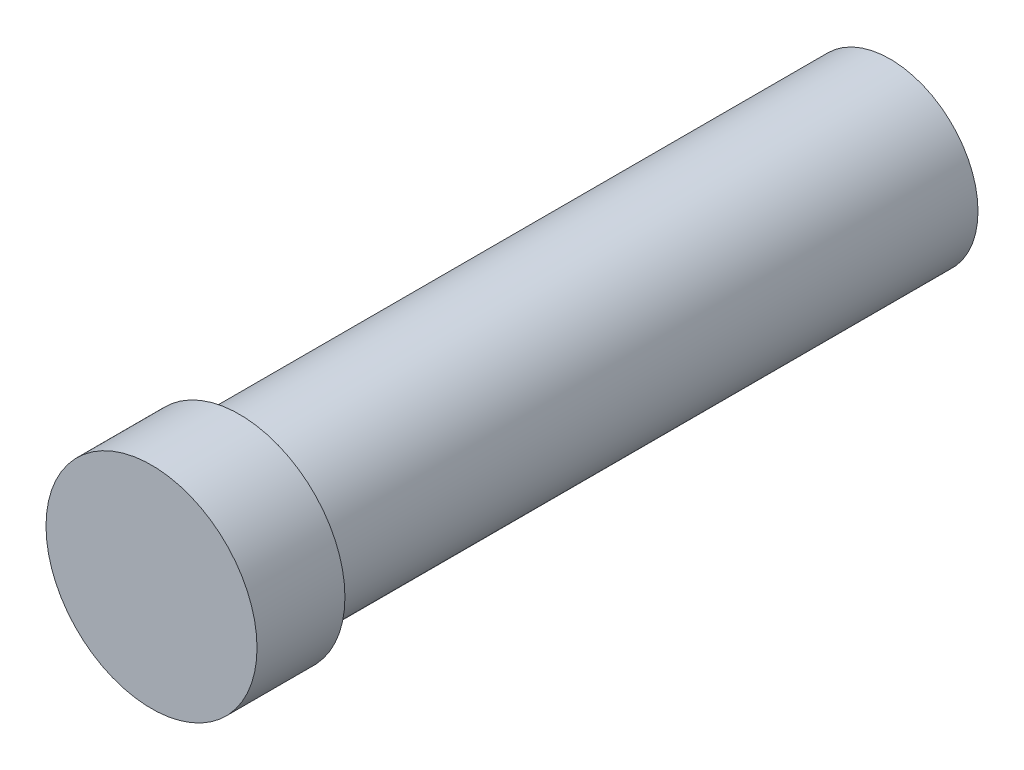
ISO-10303-21;
HEADER;
FILE_DESCRIPTION(('STEP AP214'),'2;1');
FILE_NAME('part.step','',(''),(''),'','','');
FILE_SCHEMA(('AUTOMOTIVE_DESIGN { 1 0 10303 214 1 1 1 1 }'));
ENDSEC;
DATA;
#1=APPLICATION_CONTEXT('core data for automotive mechanical design processes');
#2=APPLICATION_PROTOCOL_DEFINITION('international standard','automotive_design',2000,#1);
#3=PRODUCT_CONTEXT('',#1,'mechanical');
#4=PRODUCT('Part','Part','',(#3));
#5=PRODUCT_RELATED_PRODUCT_CATEGORY('part','',(#4));
#6=PRODUCT_DEFINITION_FORMATION('','',#4);
#7=PRODUCT_DEFINITION_CONTEXT('part definition',#1,'design');
#8=PRODUCT_DEFINITION('design','',#6,#7);
#9=PRODUCT_DEFINITION_SHAPE('','',#8);
#10=(LENGTH_UNIT() NAMED_UNIT(*) SI_UNIT(.MILLI.,.METRE.));
#11=(NAMED_UNIT(*) PLANE_ANGLE_UNIT() SI_UNIT($,.RADIAN.));
#12=(NAMED_UNIT(*) SI_UNIT($,.STERADIAN.) SOLID_ANGLE_UNIT());
#13=UNCERTAINTY_MEASURE_WITH_UNIT(LENGTH_MEASURE(1.E-05),#10,'distance_accuracy_value','');
#14=(GEOMETRIC_REPRESENTATION_CONTEXT(3) GLOBAL_UNCERTAINTY_ASSIGNED_CONTEXT((#13)) GLOBAL_UNIT_ASSIGNED_CONTEXT((#10,
#11,#12)) REPRESENTATION_CONTEXT('',''));
#15=CARTESIAN_POINT('',(0.,0.,0.));
#16=DIRECTION('',(0.,0.,1.));
#17=DIRECTION('',(1.,0.,0.));
#18=AXIS2_PLACEMENT_3D('',#15,#16,#17);
#19=CARTESIAN_POINT('',(0.,0.,37.));
#20=DIRECTION('',(0.,0.,-1.));
#21=DIRECTION('',(-1.,0.,0.));
#22=AXIS2_PLACEMENT_3D('',#19,#20,#21);
#23=CYLINDRICAL_SURFACE('',#22,5.);
#24=CARTESIAN_POINT('',(0.,0.,37.));
#25=DIRECTION('',(0.,0.,1.));
#26=DIRECTION('',(1.,0.,0.));
#27=AXIS2_PLACEMENT_3D('',#24,#25,#26);
#28=CIRCLE('',#27,5.);
#29=CARTESIAN_POINT('',(5.,0.,37.));
#30=VERTEX_POINT('',#29);
#31=EDGE_CURVE('E10',#30,#30,#28,.T.);
#32=ORIENTED_EDGE('',*,*,#31,.F.);
#33=EDGE_LOOP('',(#32));
#34=FACE_BOUND('',#33,.T.);
#35=CARTESIAN_POINT('',(0.,0.,0.));
#36=DIRECTION('',(0.,0.,1.));
#37=DIRECTION('',(1.,0.,0.));
#38=AXIS2_PLACEMENT_3D('',#35,#36,#37);
#39=CIRCLE('',#38,5.);
#40=CARTESIAN_POINT('',(5.,0.,0.));
#41=VERTEX_POINT('',#40);
#42=EDGE_CURVE('E40',#41,#41,#39,.T.);
#43=ORIENTED_EDGE('',*,*,#42,.T.);
#44=EDGE_LOOP('',(#43));
#45=FACE_BOUND('',#44,.T.);
#46=ADVANCED_FACE('F37',(#34,#45),#23,.T.);
#47=CARTESIAN_POINT('',(0.,0.,0.));
#48=DIRECTION('',(0.,0.,1.));
#49=DIRECTION('',(1.,0.,0.));
#50=AXIS2_PLACEMENT_3D('',#47,#48,#49);
#51=PLANE('',#50);
#52=ORIENTED_EDGE('',*,*,#42,.F.);
#53=EDGE_LOOP('',(#52));
#54=FACE_BOUND('',#53,.T.);
#55=ADVANCED_FACE('F64',(#54),#51,.F.);
#56=CARTESIAN_POINT('',(0.,0.,42.));
#57=DIRECTION('',(0.,0.,-1.));
#58=DIRECTION('',(-1.,0.,0.));
#59=AXIS2_PLACEMENT_3D('',#56,#57,#58);
#60=CYLINDRICAL_SURFACE('',#59,6.);
#61=CARTESIAN_POINT('',(0.,0.,42.));
#62=DIRECTION('',(0.,0.,1.));
#63=DIRECTION('',(1.,0.,0.));
#64=AXIS2_PLACEMENT_3D('',#61,#62,#63);
#65=CIRCLE('',#64,6.);
#66=CARTESIAN_POINT('',(6.,0.,42.));
#67=VERTEX_POINT('',#66);
#68=EDGE_CURVE('E49',#67,#67,#65,.T.);
#69=ORIENTED_EDGE('',*,*,#68,.F.);
#70=EDGE_LOOP('',(#69));
#71=FACE_BOUND('',#70,.T.);
#72=CARTESIAN_POINT('',(0.,0.,37.));
#73=DIRECTION('',(0.,0.,1.));
#74=DIRECTION('',(1.,0.,0.));
#75=AXIS2_PLACEMENT_3D('',#72,#73,#74);
#76=CIRCLE('',#75,6.);
#77=CARTESIAN_POINT('',(6.,0.,37.));
#78=VERTEX_POINT('',#77);
#79=EDGE_CURVE('E51',#78,#78,#76,.T.);
#80=ORIENTED_EDGE('',*,*,#79,.T.);
#81=EDGE_LOOP('',(#80));
#82=FACE_BOUND('',#81,.T.);
#83=ADVANCED_FACE('F61',(#71,#82),#60,.T.);
#84=CARTESIAN_POINT('',(0.,0.,42.));
#85=DIRECTION('',(0.,0.,1.));
#86=DIRECTION('',(1.,0.,0.));
#87=AXIS2_PLACEMENT_3D('',#84,#85,#86);
#88=PLANE('',#87);
#89=ORIENTED_EDGE('',*,*,#68,.T.);
#90=EDGE_LOOP('',(#89));
#91=FACE_BOUND('',#90,.T.);
#92=ADVANCED_FACE('F59',(#91),#88,.T.);
#93=CARTESIAN_POINT('',(0.,0.,37.));
#94=DIRECTION('',(0.,0.,1.));
#95=DIRECTION('',(1.,0.,0.));
#96=AXIS2_PLACEMENT_3D('',#93,#94,#95);
#97=PLANE('',#96);
#98=ORIENTED_EDGE('',*,*,#31,.T.);
#99=EDGE_LOOP('',(#98));
#100=FACE_BOUND('',#99,.T.);
#101=ORIENTED_EDGE('',*,*,#79,.F.);
#102=EDGE_LOOP('',(#101));
#103=FACE_BOUND('',#102,.T.);
#104=ADVANCED_FACE('F68',(#100,#103),#97,.F.);
#105=CLOSED_SHELL('',(#46,#55,#83,#92,#104));
#106=MANIFOLD_SOLID_BREP('B2',#105);
#107=ADVANCED_BREP_SHAPE_REPRESENTATION('',(#18,#106),#14);
#108=SHAPE_DEFINITION_REPRESENTATION(#9,#107);
ENDSEC;
END-ISO-10303-21;
